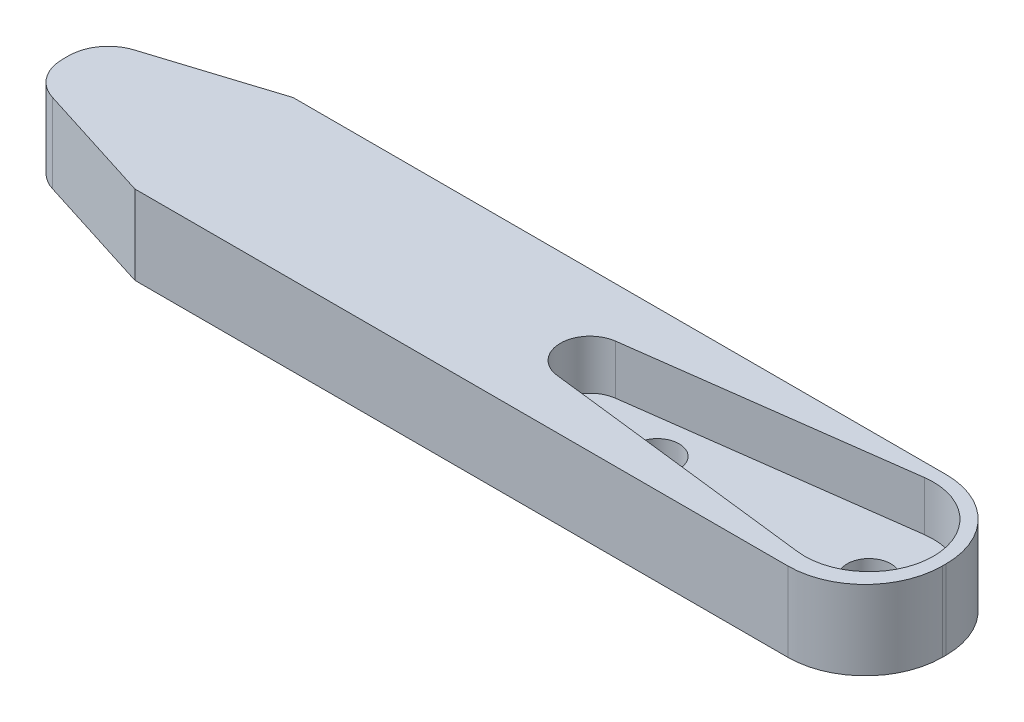
ISO-10303-21;
HEADER;
FILE_DESCRIPTION(('STEP AP214'),'2;1');
FILE_NAME('part.step','',(''),(''),'','','');
FILE_SCHEMA(('AUTOMOTIVE_DESIGN { 1 0 10303 214 1 1 1 1 }'));
ENDSEC;
DATA;
#1=APPLICATION_CONTEXT('core data for automotive mechanical design processes');
#2=APPLICATION_PROTOCOL_DEFINITION('international standard','automotive_design',2000,#1);
#3=PRODUCT_CONTEXT('',#1,'mechanical');
#4=PRODUCT('Part','Part','',(#3));
#5=PRODUCT_RELATED_PRODUCT_CATEGORY('part','',(#4));
#6=PRODUCT_DEFINITION_FORMATION('','',#4);
#7=PRODUCT_DEFINITION_CONTEXT('part definition',#1,'design');
#8=PRODUCT_DEFINITION('design','',#6,#7);
#9=PRODUCT_DEFINITION_SHAPE('','',#8);
#10=(LENGTH_UNIT() NAMED_UNIT(*) SI_UNIT(.MILLI.,.METRE.));
#11=(NAMED_UNIT(*) PLANE_ANGLE_UNIT() SI_UNIT($,.RADIAN.));
#12=(NAMED_UNIT(*) SI_UNIT($,.STERADIAN.) SOLID_ANGLE_UNIT());
#13=UNCERTAINTY_MEASURE_WITH_UNIT(LENGTH_MEASURE(1.E-05),#10,'distance_accuracy_value','');
#14=(GEOMETRIC_REPRESENTATION_CONTEXT(3) GLOBAL_UNCERTAINTY_ASSIGNED_CONTEXT((#13)) GLOBAL_UNIT_ASSIGNED_CONTEXT((#10,
#11,#12)) REPRESENTATION_CONTEXT('',''));
#15=CARTESIAN_POINT('',(0.,0.,0.));
#16=DIRECTION('',(0.,0.,1.));
#17=DIRECTION('',(1.,0.,0.));
#18=AXIS2_PLACEMENT_3D('',#15,#16,#17);
#19=CARTESIAN_POINT('',(17.1,4.,-0.100000000000001));
#20=DIRECTION('',(0.,-1.,0.));
#21=DIRECTION('',(0.,0.,-1.));
#22=AXIS2_PLACEMENT_3D('',#19,#20,#21);
#23=CYLINDRICAL_SURFACE('',#22,3.9);
#24=CARTESIAN_POINT('',(17.1,0.,-0.100000000000001));
#25=DIRECTION('',(0.,1.,0.));
#26=DIRECTION('',(0.,0.,-1.));
#27=AXIS2_PLACEMENT_3D('',#24,#25,#26);
#28=CIRCLE('',#27,3.9);
#29=CARTESIAN_POINT('',(21.,0.,-0.0999999999999734));
#30=VERTEX_POINT('',#29);
#31=CARTESIAN_POINT('',(17.1,0.,-4.));
#32=VERTEX_POINT('',#31);
#33=EDGE_CURVE('E155',#30,#32,#28,.T.);
#34=ORIENTED_EDGE('',*,*,#33,.T.);
#35=DIRECTION('',(0.,-1.,0.));
#36=VECTOR('',#35,1.);
#37=CARTESIAN_POINT('',(17.1,4.,-4.));
#38=LINE('',#37,#36);
#39=CARTESIAN_POINT('',(17.1,4.,-4.));
#40=VERTEX_POINT('',#39);
#41=EDGE_CURVE('E11',#40,#32,#38,.T.);
#42=ORIENTED_EDGE('',*,*,#41,.F.);
#43=CARTESIAN_POINT('',(17.1,4.,-0.100000000000001));
#44=DIRECTION('',(0.,1.,0.));
#45=DIRECTION('',(0.,0.,-1.));
#46=AXIS2_PLACEMENT_3D('',#43,#44,#45);
#47=CIRCLE('',#46,3.9);
#48=CARTESIAN_POINT('',(21.,4.,-0.0999999999999734));
#49=VERTEX_POINT('',#48);
#50=EDGE_CURVE('E175',#49,#40,#47,.T.);
#51=ORIENTED_EDGE('',*,*,#50,.F.);
#52=DIRECTION('',(0.,-1.,0.));
#53=VECTOR('',#52,1.);
#54=CARTESIAN_POINT('',(21.,4.,-0.0999999999999734));
#55=LINE('',#54,#53);
#56=EDGE_CURVE('E151',#49,#30,#55,.T.);
#57=ORIENTED_EDGE('',*,*,#56,.T.);
#58=EDGE_LOOP('',(#34,#42,#51,#57));
#59=FACE_BOUND('',#58,.T.);
#60=ADVANCED_FACE('F35',(#59),#23,.T.);
#61=CARTESIAN_POINT('',(-15.9,4.,-4.));
#62=DIRECTION('',(0.,0.,1.));
#63=DIRECTION('',(1.,0.,0.));
#64=AXIS2_PLACEMENT_3D('',#61,#62,#63);
#65=PLANE('',#64);
#66=DIRECTION('',(-1.,0.,0.));
#67=VECTOR('',#66,1.);
#68=CARTESIAN_POINT('',(-15.9,0.,-4.));
#69=LINE('',#68,#67);
#70=CARTESIAN_POINT('',(-15.9,0.,-4.));
#71=VERTEX_POINT('',#70);
#72=EDGE_CURVE('E158',#32,#71,#69,.T.);
#73=ORIENTED_EDGE('',*,*,#72,.T.);
#74=DIRECTION('',(0.,-1.,0.));
#75=VECTOR('',#74,1.);
#76=CARTESIAN_POINT('',(-15.9,4.,-4.));
#77=LINE('',#76,#75);
#78=CARTESIAN_POINT('',(-15.9,4.,-4.));
#79=VERTEX_POINT('',#78);
#80=EDGE_CURVE('E42',#79,#71,#77,.T.);
#81=ORIENTED_EDGE('',*,*,#80,.F.);
#82=DIRECTION('',(-1.,0.,0.));
#83=VECTOR('',#82,1.);
#84=CARTESIAN_POINT('',(-15.9,4.,-4.));
#85=LINE('',#84,#83);
#86=EDGE_CURVE('E105',#40,#79,#85,.T.);
#87=ORIENTED_EDGE('',*,*,#86,.F.);
#88=ORIENTED_EDGE('',*,*,#41,.T.);
#89=EDGE_LOOP('',(#73,#81,#87,#88));
#90=FACE_BOUND('',#89,.T.);
#91=ADVANCED_FACE('F318',(#90),#65,.F.);
#92=CARTESIAN_POINT('',(-22.0064881287538,4.,-2.0684206216595));
#93=DIRECTION('',(0.301587747597695,0.,0.95343842512191));
#94=DIRECTION('',(0.95343842512191,0.,-0.301587747597695));
#95=AXIS2_PLACEMENT_3D('',#92,#93,#94);
#96=PLANE('',#95);
#97=DIRECTION('',(-0.95343842512191,0.,0.301587747597695));
#98=VECTOR('',#97,1.);
#99=CARTESIAN_POINT('',(-22.0064881287538,0.,-2.0684206216595));
#100=LINE('',#99,#98);
#101=CARTESIAN_POINT('',(-22.0064881287538,0.,-2.0684206216595));
#102=VERTEX_POINT('',#101);
#103=EDGE_CURVE('E161',#71,#102,#100,.T.);
#104=ORIENTED_EDGE('',*,*,#103,.T.);
#105=DIRECTION('',(0.,-1.,0.));
#106=VECTOR('',#105,1.);
#107=CARTESIAN_POINT('',(-22.0064881287538,4.,-2.0684206216595));
#108=LINE('',#107,#106);
#109=CARTESIAN_POINT('',(-22.0064881287538,4.,-2.0684206216595));
#110=VERTEX_POINT('',#109);
#111=EDGE_CURVE('E188',#110,#102,#108,.T.);
#112=ORIENTED_EDGE('',*,*,#111,.F.);
#113=DIRECTION('',(-0.95343842512191,0.,0.301587747597695));
#114=VECTOR('',#113,1.);
#115=CARTESIAN_POINT('',(-22.0064881287538,4.,-2.0684206216595));
#116=LINE('',#115,#114);
#117=EDGE_CURVE('E196',#79,#110,#116,.T.);
#118=ORIENTED_EDGE('',*,*,#117,.F.);
#119=ORIENTED_EDGE('',*,*,#80,.T.);
#120=EDGE_LOOP('',(#104,#112,#118,#119));
#121=FACE_BOUND('',#120,.T.);
#122=ADVANCED_FACE('F194',(#121),#96,.F.);
#123=CARTESIAN_POINT('',(-21.4033126335584,4.,-0.161543771415684));
#124=DIRECTION('',(0.,-1.,0.));
#125=DIRECTION('',(0.,0.,-1.));
#126=AXIS2_PLACEMENT_3D('',#123,#124,#125);
#127=CYLINDRICAL_SURFACE('',#126,2.);
#128=CARTESIAN_POINT('',(-21.4033126335584,0.,-0.161543771415684));
#129=DIRECTION('',(0.,1.,0.));
#130=DIRECTION('',(0.,0.,1.));
#131=AXIS2_PLACEMENT_3D('',#128,#129,#130);
#132=CIRCLE('',#131,2.);
#133=CARTESIAN_POINT('',(-23.4033126335584,0.,-0.161543771415684));
#134=VERTEX_POINT('',#133);
#135=EDGE_CURVE('E163',#102,#134,#132,.T.);
#136=ORIENTED_EDGE('',*,*,#135,.T.);
#137=DIRECTION('',(0.,-1.,0.));
#138=VECTOR('',#137,1.);
#139=CARTESIAN_POINT('',(-23.4033126335584,4.,-0.161543771415684));
#140=LINE('',#139,#138);
#141=CARTESIAN_POINT('',(-23.4033126335584,4.,-0.161543771415684));
#142=VERTEX_POINT('',#141);
#143=EDGE_CURVE('E185',#142,#134,#140,.T.);
#144=ORIENTED_EDGE('',*,*,#143,.F.);
#145=CARTESIAN_POINT('',(-21.4033126335584,4.,-0.161543771415684));
#146=DIRECTION('',(0.,1.,0.));
#147=DIRECTION('',(0.,0.,1.));
#148=AXIS2_PLACEMENT_3D('',#145,#146,#147);
#149=CIRCLE('',#148,2.);
#150=EDGE_CURVE('E214',#110,#142,#149,.T.);
#151=ORIENTED_EDGE('',*,*,#150,.F.);
#152=ORIENTED_EDGE('',*,*,#111,.T.);
#153=EDGE_LOOP('',(#136,#144,#151,#152));
#154=FACE_BOUND('',#153,.T.);
#155=ADVANCED_FACE('F205',(#154),#127,.T.);
#156=CARTESIAN_POINT('',(-23.4033126335584,4.,-0.161543771415684));
#157=DIRECTION('',(1.,0.,0.));
#158=DIRECTION('',(0.,0.,-1.));
#159=AXIS2_PLACEMENT_3D('',#156,#157,#158);
#160=PLANE('',#159);
#161=DIRECTION('',(0.,0.,1.));
#162=VECTOR('',#161,1.);
#163=CARTESIAN_POINT('',(-23.4033126335584,0.,-0.161543771415684));
#164=LINE('',#163,#162);
#165=CARTESIAN_POINT('',(-23.4033126335584,0.,0.161543771415684));
#166=VERTEX_POINT('',#165);
#167=EDGE_CURVE('E165',#134,#166,#164,.T.);
#168=ORIENTED_EDGE('',*,*,#167,.T.);
#169=DIRECTION('',(0.,-1.,0.));
#170=VECTOR('',#169,1.);
#171=CARTESIAN_POINT('',(-23.4033126335584,4.,0.161543771415684));
#172=LINE('',#171,#170);
#173=CARTESIAN_POINT('',(-23.4033126335584,4.,0.161543771415684));
#174=VERTEX_POINT('',#173);
#175=EDGE_CURVE('E182',#174,#166,#172,.T.);
#176=ORIENTED_EDGE('',*,*,#175,.F.);
#177=DIRECTION('',(0.,0.,1.));
#178=VECTOR('',#177,1.);
#179=CARTESIAN_POINT('',(-23.4033126335584,4.,-0.161543771415684));
#180=LINE('',#179,#178);
#181=EDGE_CURVE('E211',#142,#174,#180,.T.);
#182=ORIENTED_EDGE('',*,*,#181,.F.);
#183=ORIENTED_EDGE('',*,*,#143,.T.);
#184=EDGE_LOOP('',(#168,#176,#182,#183));
#185=FACE_BOUND('',#184,.T.);
#186=ADVANCED_FACE('F209',(#185),#160,.F.);
#187=CARTESIAN_POINT('',(-21.4033126335584,4.,0.161543771415684));
#188=DIRECTION('',(0.,-1.,0.));
#189=DIRECTION('',(0.,0.,-1.));
#190=AXIS2_PLACEMENT_3D('',#187,#188,#189);
#191=CYLINDRICAL_SURFACE('',#190,2.);
#192=CARTESIAN_POINT('',(-21.4033126335584,0.,0.161543771415684));
#193=DIRECTION('',(0.,1.,0.));
#194=DIRECTION('',(0.,0.,-1.));
#195=AXIS2_PLACEMENT_3D('',#192,#193,#194);
#196=CIRCLE('',#195,2.);
#197=CARTESIAN_POINT('',(-22.0064881287538,0.,2.06842062165951));
#198=VERTEX_POINT('',#197);
#199=EDGE_CURVE('E167',#166,#198,#196,.T.);
#200=ORIENTED_EDGE('',*,*,#199,.T.);
#201=DIRECTION('',(0.,-1.,0.));
#202=VECTOR('',#201,1.);
#203=CARTESIAN_POINT('',(-22.0064881287538,4.,2.06842062165951));
#204=LINE('',#203,#202);
#205=CARTESIAN_POINT('',(-22.0064881287538,4.,2.06842062165951));
#206=VERTEX_POINT('',#205);
#207=EDGE_CURVE('E179',#206,#198,#204,.T.);
#208=ORIENTED_EDGE('',*,*,#207,.F.);
#209=CARTESIAN_POINT('',(-21.4033126335584,4.,0.161543771415684));
#210=DIRECTION('',(0.,1.,0.));
#211=DIRECTION('',(0.,0.,-1.));
#212=AXIS2_PLACEMENT_3D('',#209,#210,#211);
#213=CIRCLE('',#212,2.);
#214=EDGE_CURVE('E213',#174,#206,#213,.T.);
#215=ORIENTED_EDGE('',*,*,#214,.F.);
#216=ORIENTED_EDGE('',*,*,#175,.T.);
#217=EDGE_LOOP('',(#200,#208,#215,#216));
#218=FACE_BOUND('',#217,.T.);
#219=ADVANCED_FACE('F342',(#218),#191,.T.);
#220=CARTESIAN_POINT('',(-22.0064881287538,4.,2.0684206216595));
#221=DIRECTION('',(0.301587747597695,0.,-0.95343842512191));
#222=DIRECTION('',(-0.95343842512191,0.,-0.301587747597695));
#223=AXIS2_PLACEMENT_3D('',#220,#221,#222);
#224=PLANE('',#223);
#225=DIRECTION('',(0.95343842512191,0.,0.301587747597695));
#226=VECTOR('',#225,1.);
#227=CARTESIAN_POINT('',(-22.0064881287538,0.,2.0684206216595));
#228=LINE('',#227,#226);
#229=CARTESIAN_POINT('',(-15.9,0.,4.));
#230=VERTEX_POINT('',#229);
#231=EDGE_CURVE('E169',#198,#230,#228,.T.);
#232=ORIENTED_EDGE('',*,*,#231,.T.);
#233=DIRECTION('',(0.,-1.,0.));
#234=VECTOR('',#233,1.);
#235=CARTESIAN_POINT('',(-15.9,4.,4.));
#236=LINE('',#235,#234);
#237=CARTESIAN_POINT('',(-15.9,4.,4.));
#238=VERTEX_POINT('',#237);
#239=EDGE_CURVE('E146',#238,#230,#236,.T.);
#240=ORIENTED_EDGE('',*,*,#239,.F.);
#241=DIRECTION('',(0.95343842512191,0.,0.301587747597695));
#242=VECTOR('',#241,1.);
#243=CARTESIAN_POINT('',(-22.0064881287538,4.,2.0684206216595));
#244=LINE('',#243,#242);
#245=EDGE_CURVE('E134',#206,#238,#244,.T.);
#246=ORIENTED_EDGE('',*,*,#245,.F.);
#247=ORIENTED_EDGE('',*,*,#207,.T.);
#248=EDGE_LOOP('',(#232,#240,#246,#247));
#249=FACE_BOUND('',#248,.T.);
#250=ADVANCED_FACE('F339',(#249),#224,.F.);
#251=CARTESIAN_POINT('',(-15.9,4.,4.));
#252=DIRECTION('',(0.,0.,-1.));
#253=DIRECTION('',(-1.,0.,0.));
#254=AXIS2_PLACEMENT_3D('',#251,#252,#253);
#255=PLANE('',#254);
#256=DIRECTION('',(1.,0.,0.));
#257=VECTOR('',#256,1.);
#258=CARTESIAN_POINT('',(-15.9,0.,4.));
#259=LINE('',#258,#257);
#260=CARTESIAN_POINT('',(17.1,0.,4.));
#261=VERTEX_POINT('',#260);
#262=EDGE_CURVE('E143',#230,#261,#259,.T.);
#263=ORIENTED_EDGE('',*,*,#262,.T.);
#264=DIRECTION('',(0.,-1.,0.));
#265=VECTOR('',#264,1.);
#266=CARTESIAN_POINT('',(17.1,4.,4.));
#267=LINE('',#266,#265);
#268=CARTESIAN_POINT('',(17.1,4.,4.));
#269=VERTEX_POINT('',#268);
#270=EDGE_CURVE('E140',#269,#261,#267,.T.);
#271=ORIENTED_EDGE('',*,*,#270,.F.);
#272=DIRECTION('',(1.,0.,0.));
#273=VECTOR('',#272,1.);
#274=CARTESIAN_POINT('',(-15.9,4.,4.));
#275=LINE('',#274,#273);
#276=EDGE_CURVE('E127',#238,#269,#275,.T.);
#277=ORIENTED_EDGE('',*,*,#276,.F.);
#278=ORIENTED_EDGE('',*,*,#239,.T.);
#279=EDGE_LOOP('',(#263,#271,#277,#278));
#280=FACE_BOUND('',#279,.T.);
#281=ADVANCED_FACE('F141',(#280),#255,.F.);
#282=CARTESIAN_POINT('',(17.1,4.,0.099999999999999));
#283=DIRECTION('',(0.,-1.,0.));
#284=DIRECTION('',(0.,0.,-1.));
#285=AXIS2_PLACEMENT_3D('',#282,#283,#284);
#286=CYLINDRICAL_SURFACE('',#285,3.9);
#287=CARTESIAN_POINT('',(17.1,0.,0.099999999999999));
#288=DIRECTION('',(0.,1.,0.));
#289=DIRECTION('',(0.,0.,1.));
#290=AXIS2_PLACEMENT_3D('',#287,#288,#289);
#291=CIRCLE('',#290,3.9);
#292=CARTESIAN_POINT('',(21.,0.,0.0999999999999715));
#293=VERTEX_POINT('',#292);
#294=EDGE_CURVE('E172',#261,#293,#291,.T.);
#295=ORIENTED_EDGE('',*,*,#294,.T.);
#296=DIRECTION('',(0.,-1.,0.));
#297=VECTOR('',#296,1.);
#298=CARTESIAN_POINT('',(21.,4.,0.0999999999999715));
#299=LINE('',#298,#297);
#300=CARTESIAN_POINT('',(21.,4.,0.0999999999999715));
#301=VERTEX_POINT('',#300);
#302=EDGE_CURVE('E147',#301,#293,#299,.T.);
#303=ORIENTED_EDGE('',*,*,#302,.F.);
#304=CARTESIAN_POINT('',(17.1,4.,0.099999999999999));
#305=DIRECTION('',(0.,1.,0.));
#306=DIRECTION('',(0.,0.,1.));
#307=AXIS2_PLACEMENT_3D('',#304,#305,#306);
#308=CIRCLE('',#307,3.9);
#309=EDGE_CURVE('E131',#269,#301,#308,.T.);
#310=ORIENTED_EDGE('',*,*,#309,.F.);
#311=ORIENTED_EDGE('',*,*,#270,.T.);
#312=EDGE_LOOP('',(#295,#303,#310,#311));
#313=FACE_BOUND('',#312,.T.);
#314=ADVANCED_FACE('F149',(#313),#286,.T.);
#315=CARTESIAN_POINT('',(21.,4.,-0.0999999999999734));
#316=DIRECTION('',(-1.,0.,0.));
#317=DIRECTION('',(0.,0.,1.));
#318=AXIS2_PLACEMENT_3D('',#315,#316,#317);
#319=PLANE('',#318);
#320=DIRECTION('',(0.,0.,-1.));
#321=VECTOR('',#320,1.);
#322=CARTESIAN_POINT('',(21.,0.,-0.0999999999999734));
#323=LINE('',#322,#321);
#324=EDGE_CURVE('E97',#293,#30,#323,.T.);
#325=ORIENTED_EDGE('',*,*,#324,.T.);
#326=ORIENTED_EDGE('',*,*,#56,.F.);
#327=DIRECTION('',(0.,0.,-1.));
#328=VECTOR('',#327,1.);
#329=CARTESIAN_POINT('',(21.,4.,-0.0999999999999734));
#330=LINE('',#329,#328);
#331=EDGE_CURVE('E58',#301,#49,#330,.T.);
#332=ORIENTED_EDGE('',*,*,#331,.F.);
#333=ORIENTED_EDGE('',*,*,#302,.T.);
#334=EDGE_LOOP('',(#325,#326,#332,#333));
#335=FACE_BOUND('',#334,.T.);
#336=ADVANCED_FACE('F326',(#335),#319,.F.);
#337=CARTESIAN_POINT('',(17.1,4.,-0.100000000000001));
#338=DIRECTION('',(0.,-1.,0.));
#339=DIRECTION('',(0.,0.,-1.));
#340=AXIS2_PLACEMENT_3D('',#337,#338,#339);
#341=PLANE('',#340);
#342=DIRECTION('',(-0.9912390226226,0.,0.132080278733019));
#343=VECTOR('',#342,1.);
#344=CARTESIAN_POINT('',(2.90187958190048,4.,-1.4868585339339));
#345=LINE('',#344,#343);
#346=CARTESIAN_POINT('',(16.6707390941177,4.,-3.32152682352345));
#347=VERTEX_POINT('',#346);
#348=CARTESIAN_POINT('',(2.90187958190048,4.,-1.4868585339339));
#349=VERTEX_POINT('',#348);
#350=EDGE_CURVE('E239',#347,#349,#345,.T.);
#351=ORIENTED_EDGE('',*,*,#350,.F.);
#352=CARTESIAN_POINT('',(17.1,4.,-0.100000000000001));
#353=DIRECTION('',(0.,1.,0.));
#354=DIRECTION('',(0.,0.,1.));
#355=AXIS2_PLACEMENT_3D('',#352,#353,#354);
#356=CIRCLE('',#355,3.25);
#357=CARTESIAN_POINT('',(16.7168023578491,4.,3.12733009886655));
#358=VERTEX_POINT('',#357);
#359=EDGE_CURVE('E49',#358,#347,#356,.T.);
#360=ORIENTED_EDGE('',*,*,#359,.F.);
#361=DIRECTION('',(0.993024645805091,0.,0.117906966815678));
#362=VECTOR('',#361,1.);
#363=CARTESIAN_POINT('',(2.92313954977649,4.,1.48953696870764));
#364=LINE('',#363,#362);
#365=CARTESIAN_POINT('',(2.92313954977649,4.,1.48953696870764));
#366=VERTEX_POINT('',#365);
#367=EDGE_CURVE('E232',#366,#358,#364,.T.);
#368=ORIENTED_EDGE('',*,*,#367,.F.);
#369=CARTESIAN_POINT('',(3.1,4.,0.));
#370=DIRECTION('',(0.,1.,0.));
#371=DIRECTION('',(0.,0.,1.));
#372=AXIS2_PLACEMENT_3D('',#369,#370,#371);
#373=CIRCLE('',#372,1.5);
#374=EDGE_CURVE('E236',#349,#366,#373,.T.);
#375=ORIENTED_EDGE('',*,*,#374,.F.);
#376=EDGE_LOOP('',(#351,#360,#368,#375));
#377=FACE_BOUND('',#376,.T.);
#378=ORIENTED_EDGE('',*,*,#50,.T.);
#379=ORIENTED_EDGE('',*,*,#86,.T.);
#380=ORIENTED_EDGE('',*,*,#117,.T.);
#381=ORIENTED_EDGE('',*,*,#150,.T.);
#382=ORIENTED_EDGE('',*,*,#181,.T.);
#383=ORIENTED_EDGE('',*,*,#214,.T.);
#384=ORIENTED_EDGE('',*,*,#245,.T.);
#385=ORIENTED_EDGE('',*,*,#276,.T.);
#386=ORIENTED_EDGE('',*,*,#309,.T.);
#387=ORIENTED_EDGE('',*,*,#331,.T.);
#388=EDGE_LOOP('',(#378,#379,#380,#381,#382,#383,#384,#385,#386,#387));
#389=FACE_BOUND('',#388,.T.);
#390=ADVANCED_FACE('F129',(#377,#389),#341,.F.);
#391=CARTESIAN_POINT('',(17.1,0.,-0.100000000000001));
#392=DIRECTION('',(0.,-1.,0.));
#393=DIRECTION('',(0.,0.,-1.));
#394=AXIS2_PLACEMENT_3D('',#391,#392,#393);
#395=PLANE('',#394);
#396=ORIENTED_EDGE('',*,*,#33,.F.);
#397=ORIENTED_EDGE('',*,*,#324,.F.);
#398=ORIENTED_EDGE('',*,*,#294,.F.);
#399=ORIENTED_EDGE('',*,*,#262,.F.);
#400=ORIENTED_EDGE('',*,*,#231,.F.);
#401=ORIENTED_EDGE('',*,*,#199,.F.);
#402=ORIENTED_EDGE('',*,*,#167,.F.);
#403=ORIENTED_EDGE('',*,*,#135,.F.);
#404=ORIENTED_EDGE('',*,*,#103,.F.);
#405=ORIENTED_EDGE('',*,*,#72,.F.);
#406=EDGE_LOOP('',(#396,#397,#398,#399,#400,#401,#402,#403,#404,#405));
#407=FACE_BOUND('',#406,.T.);
#408=ADVANCED_FACE('F200',(#407),#395,.T.);
#409=CARTESIAN_POINT('',(17.1,1.5,-0.100000000000001));
#410=DIRECTION('',(0.,1.,0.));
#411=DIRECTION('',(0.,0.,1.));
#412=AXIS2_PLACEMENT_3D('',#409,#410,#411);
#413=CYLINDRICAL_SURFACE('',#412,3.25);
#414=ORIENTED_EDGE('',*,*,#359,.T.);
#415=DIRECTION('',(0.,1.,0.));
#416=VECTOR('',#415,1.);
#417=CARTESIAN_POINT('',(16.6707390941177,1.5,-3.32152682352345));
#418=LINE('',#417,#416);
#419=CARTESIAN_POINT('',(16.6707390941177,1.5,-3.32152682352345));
#420=VERTEX_POINT('',#419);
#421=EDGE_CURVE('E222',#420,#347,#418,.T.);
#422=ORIENTED_EDGE('',*,*,#421,.F.);
#423=CARTESIAN_POINT('',(17.1,1.5,-0.100000000000001));
#424=DIRECTION('',(0.,1.,0.));
#425=DIRECTION('',(0.,0.,1.));
#426=AXIS2_PLACEMENT_3D('',#423,#424,#425);
#427=CIRCLE('',#426,3.25);
#428=CARTESIAN_POINT('',(16.7168023578491,1.5,3.12733009886655));
#429=VERTEX_POINT('',#428);
#430=EDGE_CURVE('E235',#429,#420,#427,.T.);
#431=ORIENTED_EDGE('',*,*,#430,.F.);
#432=DIRECTION('',(0.,1.,0.));
#433=VECTOR('',#432,1.);
#434=CARTESIAN_POINT('',(16.7168023578491,1.5,3.12733009886655));
#435=LINE('',#434,#433);
#436=EDGE_CURVE('E159',#429,#358,#435,.T.);
#437=ORIENTED_EDGE('',*,*,#436,.T.);
#438=EDGE_LOOP('',(#414,#422,#431,#437));
#439=FACE_BOUND('',#438,.T.);
#440=ADVANCED_FACE('F289',(#439),#413,.F.);
#441=CARTESIAN_POINT('',(2.92313954977649,1.5,1.48953696870764));
#442=DIRECTION('',(-0.117906966815678,0.,0.993024645805091));
#443=DIRECTION('',(0.993024645805091,0.,0.117906966815678));
#444=AXIS2_PLACEMENT_3D('',#441,#442,#443);
#445=PLANE('',#444);
#446=ORIENTED_EDGE('',*,*,#367,.T.);
#447=ORIENTED_EDGE('',*,*,#436,.F.);
#448=DIRECTION('',(0.993024645805091,0.,0.117906966815678));
#449=VECTOR('',#448,1.);
#450=CARTESIAN_POINT('',(2.92313954977649,1.5,1.48953696870764));
#451=LINE('',#450,#449);
#452=CARTESIAN_POINT('',(2.92313954977649,1.5,1.48953696870764));
#453=VERTEX_POINT('',#452);
#454=EDGE_CURVE('E225',#453,#429,#451,.T.);
#455=ORIENTED_EDGE('',*,*,#454,.F.);
#456=DIRECTION('',(0.,1.,0.));
#457=VECTOR('',#456,1.);
#458=CARTESIAN_POINT('',(2.92313954977649,1.5,1.48953696870764));
#459=LINE('',#458,#457);
#460=EDGE_CURVE('E228',#453,#366,#459,.T.);
#461=ORIENTED_EDGE('',*,*,#460,.T.);
#462=EDGE_LOOP('',(#446,#447,#455,#461));
#463=FACE_BOUND('',#462,.T.);
#464=ADVANCED_FACE('F300',(#463),#445,.F.);
#465=CARTESIAN_POINT('',(3.1,1.5,0.));
#466=DIRECTION('',(0.,1.,0.));
#467=DIRECTION('',(0.,0.,1.));
#468=AXIS2_PLACEMENT_3D('',#465,#466,#467);
#469=CYLINDRICAL_SURFACE('',#468,1.5);
#470=ORIENTED_EDGE('',*,*,#374,.T.);
#471=ORIENTED_EDGE('',*,*,#460,.F.);
#472=CARTESIAN_POINT('',(3.1,1.5,0.));
#473=DIRECTION('',(0.,1.,0.));
#474=DIRECTION('',(0.,0.,1.));
#475=AXIS2_PLACEMENT_3D('',#472,#473,#474);
#476=CIRCLE('',#475,1.5);
#477=CARTESIAN_POINT('',(2.90187958190048,1.5,-1.4868585339339));
#478=VERTEX_POINT('',#477);
#479=EDGE_CURVE('E246',#478,#453,#476,.T.);
#480=ORIENTED_EDGE('',*,*,#479,.F.);
#481=DIRECTION('',(0.,1.,0.));
#482=VECTOR('',#481,1.);
#483=CARTESIAN_POINT('',(2.90187958190048,1.5,-1.4868585339339));
#484=LINE('',#483,#482);
#485=EDGE_CURVE('E224',#478,#349,#484,.T.);
#486=ORIENTED_EDGE('',*,*,#485,.T.);
#487=EDGE_LOOP('',(#470,#471,#480,#486));
#488=FACE_BOUND('',#487,.T.);
#489=ADVANCED_FACE('F305',(#488),#469,.F.);
#490=CARTESIAN_POINT('',(2.90187958190048,1.5,-1.4868585339339));
#491=DIRECTION('',(-0.132080278733019,0.,-0.991239022622601));
#492=DIRECTION('',(-0.991239022622601,0.,0.132080278733019));
#493=AXIS2_PLACEMENT_3D('',#490,#491,#492);
#494=PLANE('',#493);
#495=ORIENTED_EDGE('',*,*,#350,.T.);
#496=ORIENTED_EDGE('',*,*,#485,.F.);
#497=DIRECTION('',(-0.9912390226226,0.,0.132080278733019));
#498=VECTOR('',#497,1.);
#499=CARTESIAN_POINT('',(2.90187958190048,1.5,-1.4868585339339));
#500=LINE('',#499,#498);
#501=EDGE_CURVE('E249',#420,#478,#500,.T.);
#502=ORIENTED_EDGE('',*,*,#501,.F.);
#503=ORIENTED_EDGE('',*,*,#421,.T.);
#504=EDGE_LOOP('',(#495,#496,#502,#503));
#505=FACE_BOUND('',#504,.T.);
#506=ADVANCED_FACE('F279',(#505),#494,.F.);
#507=CARTESIAN_POINT('',(17.1,1.5,-0.100000000000001));
#508=DIRECTION('',(0.,1.,0.));
#509=DIRECTION('',(0.,0.,1.));
#510=AXIS2_PLACEMENT_3D('',#507,#508,#509);
#511=PLANE('',#510);
#512=CARTESIAN_POINT('',(17.1,1.5,-0.100000000000001));
#513=DIRECTION('',(0.,1.,0.));
#514=DIRECTION('',(0.,0.,1.));
#515=AXIS2_PLACEMENT_3D('',#512,#513,#514);
#516=CIRCLE('',#515,1.1);
#517=CARTESIAN_POINT('',(17.1,1.5,0.999999999999999));
#518=VERTEX_POINT('',#517);
#519=EDGE_CURVE('E260',#518,#518,#516,.T.);
#520=ORIENTED_EDGE('',*,*,#519,.F.);
#521=EDGE_LOOP('',(#520));
#522=FACE_BOUND('',#521,.T.);
#523=CARTESIAN_POINT('',(6.5,1.5,0.));
#524=DIRECTION('',(0.,1.,0.));
#525=DIRECTION('',(0.,0.,1.));
#526=AXIS2_PLACEMENT_3D('',#523,#524,#525);
#527=CIRCLE('',#526,1.1);
#528=CARTESIAN_POINT('',(6.5,1.5,1.1));
#529=VERTEX_POINT('',#528);
#530=EDGE_CURVE('E254',#529,#529,#527,.T.);
#531=ORIENTED_EDGE('',*,*,#530,.F.);
#532=EDGE_LOOP('',(#531));
#533=FACE_BOUND('',#532,.T.);
#534=ORIENTED_EDGE('',*,*,#430,.T.);
#535=ORIENTED_EDGE('',*,*,#501,.T.);
#536=ORIENTED_EDGE('',*,*,#479,.T.);
#537=ORIENTED_EDGE('',*,*,#454,.T.);
#538=EDGE_LOOP('',(#534,#535,#536,#537));
#539=FACE_BOUND('',#538,.T.);
#540=ADVANCED_FACE('F275',(#522,#533,#539),#511,.T.);
#541=CARTESIAN_POINT('',(6.5,0.5,0.));
#542=DIRECTION('',(0.,1.,0.));
#543=DIRECTION('',(0.,0.,1.));
#544=AXIS2_PLACEMENT_3D('',#541,#542,#543);
#545=CYLINDRICAL_SURFACE('',#544,1.1);
#546=CARTESIAN_POINT('',(6.5,0.5,0.));
#547=DIRECTION('',(0.,1.,0.));
#548=DIRECTION('',(0.,0.,1.));
#549=AXIS2_PLACEMENT_3D('',#546,#547,#548);
#550=CIRCLE('',#549,1.1);
#551=CARTESIAN_POINT('',(6.5,0.5,1.1));
#552=VERTEX_POINT('',#551);
#553=EDGE_CURVE('E257',#552,#552,#550,.T.);
#554=ORIENTED_EDGE('',*,*,#553,.F.);
#555=EDGE_LOOP('',(#554));
#556=FACE_BOUND('',#555,.T.);
#557=ORIENTED_EDGE('',*,*,#530,.T.);
#558=EDGE_LOOP('',(#557));
#559=FACE_BOUND('',#558,.T.);
#560=ADVANCED_FACE('F278',(#556,#559),#545,.F.);
#561=CARTESIAN_POINT('',(6.5,0.5,0.));
#562=DIRECTION('',(0.,1.,0.));
#563=DIRECTION('',(0.,0.,1.));
#564=AXIS2_PLACEMENT_3D('',#561,#562,#563);
#565=PLANE('',#564);
#566=ORIENTED_EDGE('',*,*,#553,.T.);
#567=EDGE_LOOP('',(#566));
#568=FACE_BOUND('',#567,.T.);
#569=ADVANCED_FACE('F271',(#568),#565,.T.);
#570=CARTESIAN_POINT('',(17.1,0.5,-0.100000000000001));
#571=DIRECTION('',(0.,1.,0.));
#572=DIRECTION('',(0.,0.,1.));
#573=AXIS2_PLACEMENT_3D('',#570,#571,#572);
#574=CYLINDRICAL_SURFACE('',#573,1.1);
#575=CARTESIAN_POINT('',(17.1,0.5,-0.100000000000001));
#576=DIRECTION('',(0.,1.,0.));
#577=DIRECTION('',(0.,0.,1.));
#578=AXIS2_PLACEMENT_3D('',#575,#576,#577);
#579=CIRCLE('',#578,1.1);
#580=CARTESIAN_POINT('',(17.1,0.5,0.999999999999999));
#581=VERTEX_POINT('',#580);
#582=EDGE_CURVE('E243',#581,#581,#579,.T.);
#583=ORIENTED_EDGE('',*,*,#582,.F.);
#584=EDGE_LOOP('',(#583));
#585=FACE_BOUND('',#584,.T.);
#586=ORIENTED_EDGE('',*,*,#519,.T.);
#587=EDGE_LOOP('',(#586));
#588=FACE_BOUND('',#587,.T.);
#589=ADVANCED_FACE('F268',(#585,#588),#574,.F.);
#590=CARTESIAN_POINT('',(17.1,0.5,-0.100000000000001));
#591=DIRECTION('',(0.,1.,0.));
#592=DIRECTION('',(0.,0.,1.));
#593=AXIS2_PLACEMENT_3D('',#590,#591,#592);
#594=PLANE('',#593);
#595=ORIENTED_EDGE('',*,*,#582,.T.);
#596=EDGE_LOOP('',(#595));
#597=FACE_BOUND('',#596,.T.);
#598=ADVANCED_FACE('F266',(#597),#594,.T.);
#599=CLOSED_SHELL('',(#60,#91,#122,#155,#186,#219,#250,#281,#314,#336,#390,#408,#440,#464,#489,
#506,#540,#560,#569,#589,#598));
#600=MANIFOLD_SOLID_BREP('B2',#599);
#601=ADVANCED_BREP_SHAPE_REPRESENTATION('',(#18,#600),#14);
#602=SHAPE_DEFINITION_REPRESENTATION(#9,#601);
ENDSEC;
END-ISO-10303-21;
